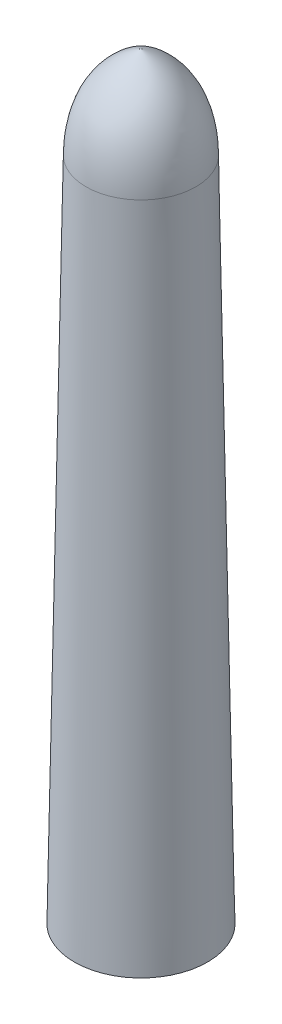
ISO-10303-21;
HEADER;
FILE_DESCRIPTION(('STEP AP214'),'2;1');
FILE_NAME('part.step','',(''),(''),'','','');
FILE_SCHEMA(('AUTOMOTIVE_DESIGN { 1 0 10303 214 1 1 1 1 }'));
ENDSEC;
DATA;
#1=APPLICATION_CONTEXT('core data for automotive mechanical design processes');
#2=APPLICATION_PROTOCOL_DEFINITION('international standard','automotive_design',2000,#1);
#3=PRODUCT_CONTEXT('',#1,'mechanical');
#4=PRODUCT('Part','Part','',(#3));
#5=PRODUCT_RELATED_PRODUCT_CATEGORY('part','',(#4));
#6=PRODUCT_DEFINITION_FORMATION('','',#4);
#7=PRODUCT_DEFINITION_CONTEXT('part definition',#1,'design');
#8=PRODUCT_DEFINITION('design','',#6,#7);
#9=PRODUCT_DEFINITION_SHAPE('','',#8);
#10=(LENGTH_UNIT() NAMED_UNIT(*) SI_UNIT(.MILLI.,.METRE.));
#11=(NAMED_UNIT(*) PLANE_ANGLE_UNIT() SI_UNIT($,.RADIAN.));
#12=(NAMED_UNIT(*) SI_UNIT($,.STERADIAN.) SOLID_ANGLE_UNIT());
#13=UNCERTAINTY_MEASURE_WITH_UNIT(LENGTH_MEASURE(1.E-05),#10,'distance_accuracy_value','');
#14=(GEOMETRIC_REPRESENTATION_CONTEXT(3) GLOBAL_UNCERTAINTY_ASSIGNED_CONTEXT((#13)) GLOBAL_UNIT_ASSIGNED_CONTEXT((#10,
#11,#12)) REPRESENTATION_CONTEXT('',''));
#15=CARTESIAN_POINT('',(0.,0.,0.));
#16=DIRECTION('',(0.,0.,1.));
#17=DIRECTION('',(1.,0.,0.));
#18=AXIS2_PLACEMENT_3D('',#15,#16,#17);
#19=CARTESIAN_POINT('',(0.,0.,0.));
#20=DIRECTION('',(0.,-1.,0.));
#21=DIRECTION('',(0.,0.,1.));
#22=AXIS2_PLACEMENT_3D('',#19,#20,#21);
#23=CONICAL_SURFACE('',#22,20.,0.0174532925199433);
#24=CARTESIAN_POINT('',(0.,200.,0.));
#25=DIRECTION('',(0.,1.,0.));
#26=DIRECTION('',(0.,0.,1.));
#27=AXIS2_PLACEMENT_3D('',#24,#25,#26);
#28=CIRCLE('',#27,16.5089870143565);
#29=CARTESIAN_POINT('',(0.,200.,16.5089870143565));
#30=VERTEX_POINT('',#29);
#31=EDGE_CURVE('E11',#30,#30,#28,.T.);
#32=ORIENTED_EDGE('',*,*,#31,.F.);
#33=EDGE_LOOP('',(#32));
#34=FACE_BOUND('',#33,.T.);
#35=CARTESIAN_POINT('',(0.,0.,0.));
#36=DIRECTION('',(0.,1.,0.));
#37=DIRECTION('',(0.,0.,1.));
#38=AXIS2_PLACEMENT_3D('',#35,#36,#37);
#39=CIRCLE('',#38,20.);
#40=CARTESIAN_POINT('',(0.,0.,20.));
#41=VERTEX_POINT('',#40);
#42=EDGE_CURVE('E42',#41,#41,#39,.T.);
#43=ORIENTED_EDGE('',*,*,#42,.T.);
#44=EDGE_LOOP('',(#43));
#45=FACE_BOUND('',#44,.T.);
#46=ADVANCED_FACE('F35',(#34,#45),#23,.T.);
#47=CARTESIAN_POINT('',(0.,0.,0.));
#48=DIRECTION('',(0.,1.,0.));
#49=DIRECTION('',(0.,0.,1.));
#50=AXIS2_PLACEMENT_3D('',#47,#48,#49);
#51=PLANE('',#50);
#52=CARTESIAN_POINT('',(0.,0.,0.));
#53=DIRECTION('',(0.,-1.,0.));
#54=DIRECTION('',(0.,0.,-1.));
#55=AXIS2_PLACEMENT_3D('',#52,#53,#54);
#56=CIRCLE('',#55,18.);
#57=CARTESIAN_POINT('',(0.,0.,-18.));
#58=VERTEX_POINT('',#57);
#59=EDGE_CURVE('E75',#58,#58,#56,.T.);
#60=ORIENTED_EDGE('',*,*,#59,.F.);
#61=EDGE_LOOP('',(#60));
#62=FACE_BOUND('',#61,.T.);
#63=ORIENTED_EDGE('',*,*,#42,.F.);
#64=EDGE_LOOP('',(#63));
#65=FACE_BOUND('',#64,.T.);
#66=ADVANCED_FACE('F63',(#62,#65),#51,.F.);
#67=CARTESIAN_POINT('',(0.,0.,0.));
#68=DIRECTION('',(0.,-1.,0.));
#69=DIRECTION('',(0.,0.,-1.));
#70=AXIS2_PLACEMENT_3D('',#67,#68,#69);
#71=CONICAL_SURFACE('',#70,18.,0.0174532925199433);
#72=CARTESIAN_POINT('',(0.,200.,0.));
#73=DIRECTION('',(0.,-1.,0.));
#74=DIRECTION('',(0.,0.,-1.));
#75=AXIS2_PLACEMENT_3D('',#72,#73,#74);
#76=CIRCLE('',#75,14.5089870143565);
#77=CARTESIAN_POINT('',(0.,200.,-14.5089870143565));
#78=VERTEX_POINT('',#77);
#79=EDGE_CURVE('E74',#78,#78,#76,.T.);
#80=ORIENTED_EDGE('',*,*,#79,.F.);
#81=EDGE_LOOP('',(#80));
#82=FACE_BOUND('',#81,.T.);
#83=ORIENTED_EDGE('',*,*,#59,.T.);
#84=EDGE_LOOP('',(#83));
#85=FACE_BOUND('',#84,.T.);
#86=ADVANCED_FACE('F56',(#82,#85),#71,.F.);
#87=CARTESIAN_POINT('',(0.,227.66084039723,0.));
#88=CARTESIAN_POINT('',(16.1651503687516,220.56943035291,0.));
#89=CARTESIAN_POINT('',(16.5089870143565,200.,0.));
#90=B_SPLINE_CURVE_WITH_KNOTS('',2,(#87,#88,#89),.UNSPECIFIED.,.F.,.F.,(3,3),(0.,1.),.UNSPECIFIED.);
#91=CARTESIAN_POINT('',(0.,220.606902542389,0.));
#92=DIRECTION('',(0.,1.,0.));
#93=AXIS1_PLACEMENT('',#91,#92);
#94=SURFACE_OF_REVOLUTION('',#90,#93);
#95=ORIENTED_EDGE('',*,*,#31,.T.);
#96=EDGE_LOOP('',(#95));
#97=FACE_BOUND('',#96,.T.);
#98=CARTESIAN_POINT('',(0.,227.66084039723,0.));
#99=VERTEX_POINT('',#98);
#100=VERTEX_LOOP('',#99);
#101=FACE_BOUND('',#100,.T.);
#102=ADVANCED_FACE('F50',(#97,#101),#94,.F.);
#103=CARTESIAN_POINT('',(0.,225.66084039723,0.));
#104=CARTESIAN_POINT('',(3.66221585922425,224.4292501284,0.));
#105=CARTESIAN_POINT('',(11.6244059474139,218.277965678576,0.));
#106=CARTESIAN_POINT('',(14.3578541870104,208.687098290117,0.));
#107=CARTESIAN_POINT('',(14.5089870143565,200.,0.));
#108=B_SPLINE_CURVE_WITH_KNOTS('',3,(#103,#104,#105,#106,#107),.UNSPECIFIED.,.F.,.F.,(4,1,4),
(0.,0.332210554888688,1.),.UNSPECIFIED.);
#109=CARTESIAN_POINT('',(0.,220.606902542389,0.));
#110=DIRECTION('',(0.,1.,0.));
#111=AXIS1_PLACEMENT('',#109,#110);
#112=SURFACE_OF_REVOLUTION('',#108,#111);
#113=ORIENTED_EDGE('',*,*,#79,.T.);
#114=EDGE_LOOP('',(#113));
#115=FACE_BOUND('',#114,.T.);
#116=CARTESIAN_POINT('',(0.,225.66084039723,0.));
#117=VERTEX_POINT('',#116);
#118=VERTEX_LOOP('',#117);
#119=FACE_BOUND('',#118,.T.);
#120=ADVANCED_FACE('F48',(#115,#119),#112,.T.);
#121=CLOSED_SHELL('',(#46,#66,#86,#102,#120));
#122=MANIFOLD_SOLID_BREP('B2',#121);
#123=ADVANCED_BREP_SHAPE_REPRESENTATION('',(#18,#122),#14);
#124=SHAPE_DEFINITION_REPRESENTATION(#9,#123);
ENDSEC;
END-ISO-10303-21;
